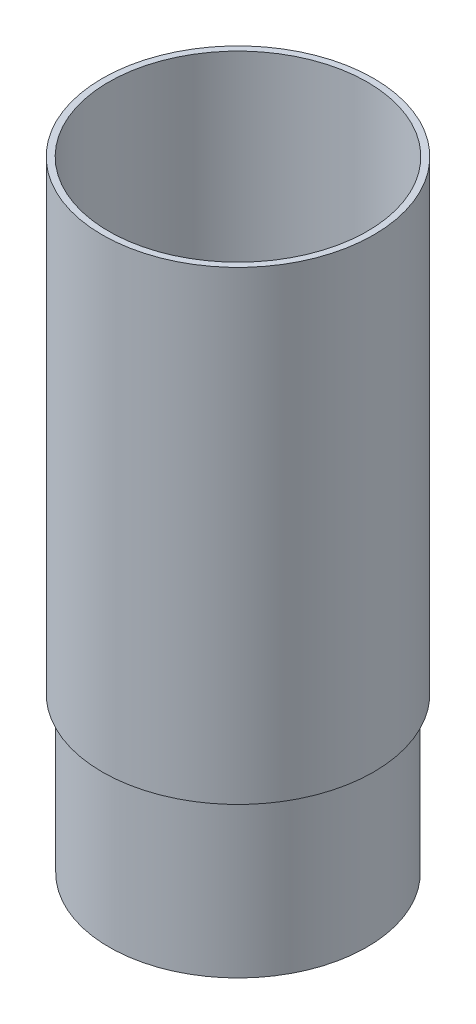
ISO-10303-21;
HEADER;
FILE_DESCRIPTION(('STEP AP214'),'2;1');
FILE_NAME('part.step','',(''),(''),'','','');
FILE_SCHEMA(('AUTOMOTIVE_DESIGN { 1 0 10303 214 1 1 1 1 }'));
ENDSEC;
DATA;
#1=APPLICATION_CONTEXT('core data for automotive mechanical design processes');
#2=APPLICATION_PROTOCOL_DEFINITION('international standard','automotive_design',2000,#1);
#3=PRODUCT_CONTEXT('',#1,'mechanical');
#4=PRODUCT('Part','Part','',(#3));
#5=PRODUCT_RELATED_PRODUCT_CATEGORY('part','',(#4));
#6=PRODUCT_DEFINITION_FORMATION('','',#4);
#7=PRODUCT_DEFINITION_CONTEXT('part definition',#1,'design');
#8=PRODUCT_DEFINITION('design','',#6,#7);
#9=PRODUCT_DEFINITION_SHAPE('','',#8);
#10=(LENGTH_UNIT() NAMED_UNIT(*) SI_UNIT(.MILLI.,.METRE.));
#11=(NAMED_UNIT(*) PLANE_ANGLE_UNIT() SI_UNIT($,.RADIAN.));
#12=(NAMED_UNIT(*) SI_UNIT($,.STERADIAN.) SOLID_ANGLE_UNIT());
#13=UNCERTAINTY_MEASURE_WITH_UNIT(LENGTH_MEASURE(1.E-05),#10,'distance_accuracy_value','');
#14=(GEOMETRIC_REPRESENTATION_CONTEXT(3) GLOBAL_UNCERTAINTY_ASSIGNED_CONTEXT((#13)) GLOBAL_UNIT_ASSIGNED_CONTEXT((#10,
#11,#12)) REPRESENTATION_CONTEXT('',''));
#15=CARTESIAN_POINT('',(0.,0.,0.));
#16=DIRECTION('',(0.,0.,1.));
#17=DIRECTION('',(1.,0.,0.));
#18=AXIS2_PLACEMENT_3D('',#15,#16,#17);
#19=CARTESIAN_POINT('',(21.1201,-6.85877928374885,1.47480870049002E-13));
#20=DIRECTION('',(0.,1.,0.));
#21=DIRECTION('',(0.,0.,1.));
#22=AXIS2_PLACEMENT_3D('',#19,#20,#21);
#23=PLANE('',#22);
#24=CARTESIAN_POINT('',(0.,-6.85877928374885,0.));
#25=DIRECTION('',(0.,-1.,0.));
#26=DIRECTION('',(0.,0.,-1.));
#27=AXIS2_PLACEMENT_3D('',#24,#25,#26);
#28=CIRCLE('',#27,20.0787);
#29=CARTESIAN_POINT('',(0.,-6.85877928374885,-20.0787));
#30=VERTEX_POINT('',#29);
#31=EDGE_CURVE('E10',#30,#30,#28,.T.);
#32=ORIENTED_EDGE('',*,*,#31,.F.);
#33=EDGE_LOOP('',(#32));
#34=FACE_BOUND('',#33,.T.);
#35=CARTESIAN_POINT('',(0.,-6.85877928374885,0.));
#36=DIRECTION('',(0.,-1.,0.));
#37=DIRECTION('',(0.,0.,-1.));
#38=AXIS2_PLACEMENT_3D('',#35,#36,#37);
#39=CIRCLE('',#38,21.1201);
#40=CARTESIAN_POINT('',(0.,-6.85877928374885,-21.1201));
#41=VERTEX_POINT('',#40);
#42=EDGE_CURVE('E59',#41,#41,#39,.T.);
#43=ORIENTED_EDGE('',*,*,#42,.T.);
#44=EDGE_LOOP('',(#43));
#45=FACE_BOUND('',#44,.T.);
#46=ADVANCED_FACE('F31',(#34,#45),#23,.F.);
#47=CARTESIAN_POINT('',(0.,0.,0.));
#48=DIRECTION('',(0.,-1.,0.));
#49=DIRECTION('',(0.,0.,-1.));
#50=AXIS2_PLACEMENT_3D('',#47,#48,#49);
#51=CYLINDRICAL_SURFACE('',#50,20.0787);
#52=CARTESIAN_POINT('',(0.,20.4449818556325,0.));
#53=DIRECTION('',(0.,-1.,0.));
#54=DIRECTION('',(0.,0.,-1.));
#55=AXIS2_PLACEMENT_3D('',#52,#53,#54);
#56=CIRCLE('',#55,20.0787);
#57=CARTESIAN_POINT('',(0.,20.4449818556325,-20.0787));
#58=VERTEX_POINT('',#57);
#59=EDGE_CURVE('E37',#58,#58,#56,.T.);
#60=ORIENTED_EDGE('',*,*,#59,.F.);
#61=EDGE_LOOP('',(#60));
#62=FACE_BOUND('',#61,.T.);
#63=ORIENTED_EDGE('',*,*,#31,.T.);
#64=EDGE_LOOP('',(#63));
#65=FACE_BOUND('',#64,.T.);
#66=ADVANCED_FACE('F96',(#62,#65),#51,.F.);
#67=CARTESIAN_POINT('',(0.,20.4449818556325,0.));
#68=DIRECTION('',(0.,1.,0.));
#69=DIRECTION('',(0.,0.,1.));
#70=AXIS2_PLACEMENT_3D('',#67,#68,#69);
#71=CONICAL_SURFACE('',#70,20.0787,0.26179938779915);
#72=CARTESIAN_POINT('',(0.,24.5685247929154,0.));
#73=DIRECTION('',(0.,-1.,0.));
#74=DIRECTION('',(0.,0.,-1.));
#75=AXIS2_PLACEMENT_3D('',#72,#73,#74);
#76=CIRCLE('',#75,21.1836);
#77=CARTESIAN_POINT('',(0.,24.5685247929154,-21.1836));
#78=VERTEX_POINT('',#77);
#79=EDGE_CURVE('E41',#78,#78,#76,.T.);
#80=ORIENTED_EDGE('',*,*,#79,.F.);
#81=EDGE_LOOP('',(#80));
#82=FACE_BOUND('',#81,.T.);
#83=ORIENTED_EDGE('',*,*,#59,.T.);
#84=EDGE_LOOP('',(#83));
#85=FACE_BOUND('',#84,.T.);
#86=ADVANCED_FACE('F91',(#82,#85),#71,.F.);
#87=CARTESIAN_POINT('',(0.,0.,0.));
#88=DIRECTION('',(0.,-1.,0.));
#89=DIRECTION('',(0.,0.,-1.));
#90=AXIS2_PLACEMENT_3D('',#87,#88,#89);
#91=CYLINDRICAL_SURFACE('',#90,21.1836);
#92=CARTESIAN_POINT('',(0.,94.7412207162511,0.));
#93=DIRECTION('',(0.,-1.,0.));
#94=DIRECTION('',(0.,0.,-1.));
#95=AXIS2_PLACEMENT_3D('',#92,#93,#94);
#96=CIRCLE('',#95,21.1836);
#97=CARTESIAN_POINT('',(0.,94.7412207162511,-21.1836));
#98=VERTEX_POINT('',#97);
#99=EDGE_CURVE('E45',#98,#98,#96,.T.);
#100=ORIENTED_EDGE('',*,*,#99,.F.);
#101=EDGE_LOOP('',(#100));
#102=FACE_BOUND('',#101,.T.);
#103=ORIENTED_EDGE('',*,*,#79,.T.);
#104=EDGE_LOOP('',(#103));
#105=FACE_BOUND('',#104,.T.);
#106=ADVANCED_FACE('F85',(#102,#105),#91,.F.);
#107=CARTESIAN_POINT('',(21.1836,94.7412207162511,1.47924288179035E-13));
#108=DIRECTION('',(0.,-1.,0.));
#109=DIRECTION('',(0.,0.,-1.));
#110=AXIS2_PLACEMENT_3D('',#107,#108,#109);
#111=PLANE('',#110);
#112=CARTESIAN_POINT('',(0.,94.7412207162511,0.));
#113=DIRECTION('',(0.,-1.,0.));
#114=DIRECTION('',(0.,0.,-1.));
#115=AXIS2_PLACEMENT_3D('',#112,#113,#114);
#116=CIRCLE('',#115,22.225);
#117=CARTESIAN_POINT('',(0.,94.7412207162511,-22.225));
#118=VERTEX_POINT('',#117);
#119=EDGE_CURVE('E50',#118,#118,#116,.T.);
#120=ORIENTED_EDGE('',*,*,#119,.F.);
#121=EDGE_LOOP('',(#120));
#122=FACE_BOUND('',#121,.T.);
#123=ORIENTED_EDGE('',*,*,#99,.T.);
#124=EDGE_LOOP('',(#123));
#125=FACE_BOUND('',#124,.T.);
#126=ADVANCED_FACE('F79',(#122,#125),#111,.F.);
#127=CARTESIAN_POINT('',(0.,0.,0.));
#128=DIRECTION('',(0.,-1.,0.));
#129=DIRECTION('',(0.,0.,-1.));
#130=AXIS2_PLACEMENT_3D('',#127,#128,#129);
#131=CYLINDRICAL_SURFACE('',#130,22.225);
#132=CARTESIAN_POINT('',(0.,18.5412207162511,0.));
#133=DIRECTION('',(0.,-1.,0.));
#134=DIRECTION('',(0.,0.,-1.));
#135=AXIS2_PLACEMENT_3D('',#132,#133,#134);
#136=CIRCLE('',#135,22.225);
#137=CARTESIAN_POINT('',(0.,18.5412207162511,-22.225));
#138=VERTEX_POINT('',#137);
#139=EDGE_CURVE('E53',#138,#138,#136,.T.);
#140=ORIENTED_EDGE('',*,*,#139,.F.);
#141=EDGE_LOOP('',(#140));
#142=FACE_BOUND('',#141,.T.);
#143=ORIENTED_EDGE('',*,*,#119,.T.);
#144=EDGE_LOOP('',(#143));
#145=FACE_BOUND('',#144,.T.);
#146=ADVANCED_FACE('F73',(#142,#145),#131,.T.);
#147=CARTESIAN_POINT('',(22.225,18.5412207162511,1.55196345511577E-13));
#148=DIRECTION('',(0.,1.,0.));
#149=DIRECTION('',(0.,0.,1.));
#150=AXIS2_PLACEMENT_3D('',#147,#148,#149);
#151=PLANE('',#150);
#152=CARTESIAN_POINT('',(0.,18.5412207162511,0.));
#153=DIRECTION('',(0.,-1.,0.));
#154=DIRECTION('',(0.,0.,-1.));
#155=AXIS2_PLACEMENT_3D('',#152,#153,#154);
#156=CIRCLE('',#155,21.1201);
#157=CARTESIAN_POINT('',(0.,18.5412207162511,-21.1201));
#158=VERTEX_POINT('',#157);
#159=EDGE_CURVE('E56',#158,#158,#156,.T.);
#160=ORIENTED_EDGE('',*,*,#159,.F.);
#161=EDGE_LOOP('',(#160));
#162=FACE_BOUND('',#161,.T.);
#163=ORIENTED_EDGE('',*,*,#139,.T.);
#164=EDGE_LOOP('',(#163));
#165=FACE_BOUND('',#164,.T.);
#166=ADVANCED_FACE('F67',(#162,#165),#151,.F.);
#167=CARTESIAN_POINT('',(0.,0.,0.));
#168=DIRECTION('',(0.,-1.,0.));
#169=DIRECTION('',(0.,0.,-1.));
#170=AXIS2_PLACEMENT_3D('',#167,#168,#169);
#171=CYLINDRICAL_SURFACE('',#170,21.1201);
#172=ORIENTED_EDGE('',*,*,#42,.F.);
#173=EDGE_LOOP('',(#172));
#174=FACE_BOUND('',#173,.T.);
#175=ORIENTED_EDGE('',*,*,#159,.T.);
#176=EDGE_LOOP('',(#175));
#177=FACE_BOUND('',#176,.T.);
#178=ADVANCED_FACE('F64',(#174,#177),#171,.T.);
#179=CLOSED_SHELL('',(#46,#66,#86,#106,#126,#146,#166,#178));
#180=MANIFOLD_SOLID_BREP('B2',#179);
#181=ADVANCED_BREP_SHAPE_REPRESENTATION('',(#18,#180),#14);
#182=SHAPE_DEFINITION_REPRESENTATION(#9,#181);
ENDSEC;
END-ISO-10303-21;
